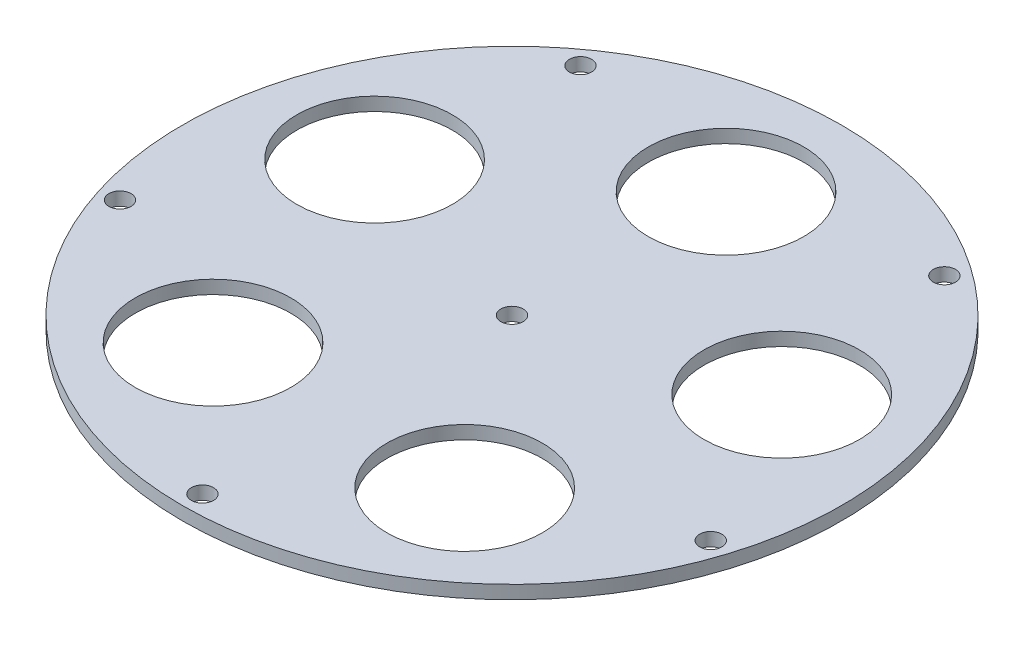
ISO-10303-21;
HEADER;
FILE_DESCRIPTION(('STEP AP214'),'2;1');
FILE_NAME('part.step','',(''),(''),'','','');
FILE_SCHEMA(('AUTOMOTIVE_DESIGN { 1 0 10303 214 1 1 1 1 }'));
ENDSEC;
DATA;
#1=APPLICATION_CONTEXT('core data for automotive mechanical design processes');
#2=APPLICATION_PROTOCOL_DEFINITION('international standard','automotive_design',2000,#1);
#3=PRODUCT_CONTEXT('',#1,'mechanical');
#4=PRODUCT('Part','Part','',(#3));
#5=PRODUCT_RELATED_PRODUCT_CATEGORY('part','',(#4));
#6=PRODUCT_DEFINITION_FORMATION('','',#4);
#7=PRODUCT_DEFINITION_CONTEXT('part definition',#1,'design');
#8=PRODUCT_DEFINITION('design','',#6,#7);
#9=PRODUCT_DEFINITION_SHAPE('','',#8);
#10=(LENGTH_UNIT() NAMED_UNIT(*) SI_UNIT(.MILLI.,.METRE.));
#11=(NAMED_UNIT(*) PLANE_ANGLE_UNIT() SI_UNIT($,.RADIAN.));
#12=(NAMED_UNIT(*) SI_UNIT($,.STERADIAN.) SOLID_ANGLE_UNIT());
#13=UNCERTAINTY_MEASURE_WITH_UNIT(LENGTH_MEASURE(1.E-05),#10,'distance_accuracy_value','');
#14=(GEOMETRIC_REPRESENTATION_CONTEXT(3) GLOBAL_UNCERTAINTY_ASSIGNED_CONTEXT((#13)) GLOBAL_UNIT_ASSIGNED_CONTEXT((#10,
#11,#12)) REPRESENTATION_CONTEXT('',''));
#15=CARTESIAN_POINT('',(0.,0.,0.));
#16=DIRECTION('',(0.,0.,1.));
#17=DIRECTION('',(1.,0.,0.));
#18=AXIS2_PLACEMENT_3D('',#15,#16,#17);
#19=CARTESIAN_POINT('',(0.,-3.,0.));
#20=DIRECTION('',(0.,1.,0.));
#21=DIRECTION('',(0.,0.,1.));
#22=AXIS2_PLACEMENT_3D('',#19,#20,#21);
#23=CYLINDRICAL_SURFACE('',#22,74.18267629);
#24=CARTESIAN_POINT('',(0.,-3.,0.));
#25=DIRECTION('',(0.,1.,0.));
#26=DIRECTION('',(0.,0.,1.));
#27=AXIS2_PLACEMENT_3D('',#24,#25,#26);
#28=CIRCLE('',#27,74.18267629);
#29=CARTESIAN_POINT('',(0.,-3.,74.18267629));
#30=VERTEX_POINT('',#29);
#31=EDGE_CURVE('E10',#30,#30,#28,.T.);
#32=ORIENTED_EDGE('',*,*,#31,.T.);
#33=EDGE_LOOP('',(#32));
#34=FACE_BOUND('',#33,.T.);
#35=CARTESIAN_POINT('',(0.,0.,0.));
#36=DIRECTION('',(0.,1.,0.));
#37=DIRECTION('',(0.,0.,1.));
#38=AXIS2_PLACEMENT_3D('',#35,#36,#37);
#39=CIRCLE('',#38,74.18267629);
#40=CARTESIAN_POINT('',(0.,0.,74.18267629));
#41=VERTEX_POINT('',#40);
#42=EDGE_CURVE('E33',#41,#41,#39,.T.);
#43=ORIENTED_EDGE('',*,*,#42,.F.);
#44=EDGE_LOOP('',(#43));
#45=FACE_BOUND('',#44,.T.);
#46=ADVANCED_FACE('F30',(#34,#45),#23,.T.);
#47=CARTESIAN_POINT('',(0.,-3.,0.));
#48=DIRECTION('',(0.,1.,0.));
#49=DIRECTION('',(0.,0.,1.));
#50=AXIS2_PLACEMENT_3D('',#47,#48,#49);
#51=PLANE('',#50);
#52=CARTESIAN_POINT('',(0.,-3.,0.));
#53=DIRECTION('',(0.,1.,0.));
#54=DIRECTION('',(0.,0.,1.));
#55=AXIS2_PLACEMENT_3D('',#52,#53,#54);
#56=CIRCLE('',#55,2.5);
#57=CARTESIAN_POINT('',(0.,-3.,2.5));
#58=VERTEX_POINT('',#57);
#59=EDGE_CURVE('E91',#58,#58,#56,.T.);
#60=ORIENTED_EDGE('',*,*,#59,.T.);
#61=EDGE_LOOP('',(#60));
#62=FACE_BOUND('',#61,.T.);
#63=CARTESIAN_POINT('',(-66.605033139194,-3.,21.6412871351681));
#64=DIRECTION('',(0.,1.,0.));
#65=DIRECTION('',(0.,0.,1.));
#66=AXIS2_PLACEMENT_3D('',#63,#64,#65);
#67=CIRCLE('',#66,2.5);
#68=CARTESIAN_POINT('',(-66.605033139194,-3.,24.1412871351681));
#69=VERTEX_POINT('',#68);
#70=EDGE_CURVE('E69',#69,#69,#67,.T.);
#71=ORIENTED_EDGE('',*,*,#70,.T.);
#72=EDGE_LOOP('',(#71));
#73=FACE_BOUND('',#72,.T.);
#74=CARTESIAN_POINT('',(0.,-3.,69.68267629));
#75=DIRECTION('',(0.,1.,0.));
#76=DIRECTION('',(0.,0.,1.));
#77=AXIS2_PLACEMENT_3D('',#74,#75,#76);
#78=CIRCLE('',#77,2.5);
#79=CARTESIAN_POINT('',(0.,-3.,72.18267629));
#80=VERTEX_POINT('',#79);
#81=EDGE_CURVE('E74',#80,#80,#78,.T.);
#82=ORIENTED_EDGE('',*,*,#81,.T.);
#83=EDGE_LOOP('',(#82));
#84=FACE_BOUND('',#83,.T.);
#85=CARTESIAN_POINT('',(66.2721633584904,-3.,21.5331311871379));
#86=DIRECTION('',(0.,1.,0.));
#87=DIRECTION('',(0.,0.,1.));
#88=AXIS2_PLACEMENT_3D('',#85,#86,#87);
#89=CIRCLE('',#88,2.5);
#90=CARTESIAN_POINT('',(66.2721633584904,-3.,24.0331311871379));
#91=VERTEX_POINT('',#90);
#92=EDGE_CURVE('E77',#91,#91,#89,.T.);
#93=ORIENTED_EDGE('',*,*,#92,.T.);
#94=EDGE_LOOP('',(#93));
#95=FACE_BOUND('',#94,.T.);
#96=CARTESIAN_POINT('',(40.9584494635325,-3.,-56.3744693321381));
#97=DIRECTION('',(0.,1.,0.));
#98=DIRECTION('',(0.,0.,1.));
#99=AXIS2_PLACEMENT_3D('',#96,#97,#98);
#100=CIRCLE('',#99,2.5);
#101=CARTESIAN_POINT('',(40.9584494635325,-3.,-53.8744693321381));
#102=VERTEX_POINT('',#101);
#103=EDGE_CURVE('E80',#102,#102,#100,.T.);
#104=ORIENTED_EDGE('',*,*,#103,.T.);
#105=EDGE_LOOP('',(#104));
#106=FACE_BOUND('',#105,.T.);
#107=CARTESIAN_POINT('',(-40.9584494635321,-3.,-56.3744693321385));
#108=DIRECTION('',(0.,1.,0.));
#109=DIRECTION('',(0.,0.,1.));
#110=AXIS2_PLACEMENT_3D('',#107,#108,#109);
#111=CIRCLE('',#110,2.5);
#112=CARTESIAN_POINT('',(-40.9584494635321,-3.,-53.8744693321385));
#113=VERTEX_POINT('',#112);
#114=EDGE_CURVE('E83',#113,#113,#111,.T.);
#115=ORIENTED_EDGE('',*,*,#114,.T.);
#116=EDGE_LOOP('',(#115));
#117=FACE_BOUND('',#116,.T.);
#118=CARTESIAN_POINT('',(28.3210665392446,-3.,38.9806039530766));
#119=DIRECTION('',(0.,1.,0.));
#120=DIRECTION('',(0.,0.,1.));
#121=AXIS2_PLACEMENT_3D('',#118,#119,#120);
#122=CIRCLE('',#121,17.5);
#123=CARTESIAN_POINT('',(28.3210665392446,-3.,56.4806039530766));
#124=VERTEX_POINT('',#123);
#125=EDGE_CURVE('E40',#124,#124,#122,.T.);
#126=ORIENTED_EDGE('',*,*,#125,.T.);
#127=EDGE_LOOP('',(#126));
#128=FACE_BOUND('',#127,.T.);
#129=CARTESIAN_POINT('',(45.8244482581444,-3.,-14.8892658080771));
#130=DIRECTION('',(0.,1.,0.));
#131=DIRECTION('',(0.,0.,1.));
#132=AXIS2_PLACEMENT_3D('',#129,#130,#131);
#133=CIRCLE('',#132,17.5);
#134=CARTESIAN_POINT('',(45.8244482581444,-3.,2.61073419192295));
#135=VERTEX_POINT('',#134);
#136=EDGE_CURVE('E44',#135,#135,#133,.T.);
#137=ORIENTED_EDGE('',*,*,#136,.T.);
#138=EDGE_LOOP('',(#137));
#139=FACE_BOUND('',#138,.T.);
#140=CARTESIAN_POINT('',(0.,-3.,-48.18267629));
#141=DIRECTION('',(0.,1.,0.));
#142=DIRECTION('',(0.,0.,1.));
#143=AXIS2_PLACEMENT_3D('',#140,#141,#142);
#144=CIRCLE('',#143,17.5);
#145=CARTESIAN_POINT('',(0.,-3.,-30.68267629));
#146=VERTEX_POINT('',#145);
#147=EDGE_CURVE('E47',#146,#146,#144,.T.);
#148=ORIENTED_EDGE('',*,*,#147,.T.);
#149=EDGE_LOOP('',(#148));
#150=FACE_BOUND('',#149,.T.);
#151=CARTESIAN_POINT('',(-45.8244482581448,-3.,-14.8892658080758));
#152=DIRECTION('',(0.,1.,0.));
#153=DIRECTION('',(0.,0.,1.));
#154=AXIS2_PLACEMENT_3D('',#151,#152,#153);
#155=CIRCLE('',#154,17.5);
#156=CARTESIAN_POINT('',(-45.8244482581448,-3.,2.61073419192416));
#157=VERTEX_POINT('',#156);
#158=EDGE_CURVE('E50',#157,#157,#155,.T.);
#159=ORIENTED_EDGE('',*,*,#158,.T.);
#160=EDGE_LOOP('',(#159));
#161=FACE_BOUND('',#160,.T.);
#162=CARTESIAN_POINT('',(-28.3210665392436,-3.,38.9806039530773));
#163=DIRECTION('',(0.,1.,0.));
#164=DIRECTION('',(0.,0.,1.));
#165=AXIS2_PLACEMENT_3D('',#162,#163,#164);
#166=CIRCLE('',#165,17.5);
#167=CARTESIAN_POINT('',(-28.3210665392436,-3.,56.4806039530773));
#168=VERTEX_POINT('',#167);
#169=EDGE_CURVE('E53',#168,#168,#166,.T.);
#170=ORIENTED_EDGE('',*,*,#169,.T.);
#171=EDGE_LOOP('',(#170));
#172=FACE_BOUND('',#171,.T.);
#173=ORIENTED_EDGE('',*,*,#31,.F.);
#174=EDGE_LOOP('',(#173));
#175=FACE_BOUND('',#174,.T.);
#176=ADVANCED_FACE('F115',(#62,#73,#84,#95,#106,#117,#128,#139,#150,#161,#172,#175),#51,.F.);
#177=CARTESIAN_POINT('',(0.,0.,0.));
#178=DIRECTION('',(0.,1.,0.));
#179=DIRECTION('',(0.,0.,1.));
#180=AXIS2_PLACEMENT_3D('',#177,#178,#179);
#181=PLANE('',#180);
#182=CARTESIAN_POINT('',(0.,0.,0.));
#183=DIRECTION('',(0.,1.,0.));
#184=DIRECTION('',(0.,0.,1.));
#185=AXIS2_PLACEMENT_3D('',#182,#183,#184);
#186=CIRCLE('',#185,2.5);
#187=CARTESIAN_POINT('',(0.,0.,2.5));
#188=VERTEX_POINT('',#187);
#189=EDGE_CURVE('E104',#188,#188,#186,.T.);
#190=ORIENTED_EDGE('',*,*,#189,.F.);
#191=EDGE_LOOP('',(#190));
#192=FACE_BOUND('',#191,.T.);
#193=CARTESIAN_POINT('',(-66.605033139194,0.,21.6412871351681));
#194=DIRECTION('',(0.,1.,0.));
#195=DIRECTION('',(0.,0.,1.));
#196=AXIS2_PLACEMENT_3D('',#193,#194,#195);
#197=CIRCLE('',#196,2.5);
#198=CARTESIAN_POINT('',(-66.605033139194,0.,24.1412871351681));
#199=VERTEX_POINT('',#198);
#200=EDGE_CURVE('E86',#199,#199,#197,.T.);
#201=ORIENTED_EDGE('',*,*,#200,.F.);
#202=EDGE_LOOP('',(#201));
#203=FACE_BOUND('',#202,.T.);
#204=CARTESIAN_POINT('',(0.,0.,69.68267629));
#205=DIRECTION('',(0.,1.,0.));
#206=DIRECTION('',(0.,0.,1.));
#207=AXIS2_PLACEMENT_3D('',#204,#205,#206);
#208=CIRCLE('',#207,2.5);
#209=CARTESIAN_POINT('',(0.,0.,72.18267629));
#210=VERTEX_POINT('',#209);
#211=EDGE_CURVE('E97',#210,#210,#208,.T.);
#212=ORIENTED_EDGE('',*,*,#211,.F.);
#213=EDGE_LOOP('',(#212));
#214=FACE_BOUND('',#213,.T.);
#215=CARTESIAN_POINT('',(66.2721633584904,0.,21.5331311871379));
#216=DIRECTION('',(0.,1.,0.));
#217=DIRECTION('',(0.,0.,1.));
#218=AXIS2_PLACEMENT_3D('',#215,#216,#217);
#219=CIRCLE('',#218,2.5);
#220=CARTESIAN_POINT('',(66.2721633584904,0.,24.0331311871379));
#221=VERTEX_POINT('',#220);
#222=EDGE_CURVE('E94',#221,#221,#219,.T.);
#223=ORIENTED_EDGE('',*,*,#222,.F.);
#224=EDGE_LOOP('',(#223));
#225=FACE_BOUND('',#224,.T.);
#226=CARTESIAN_POINT('',(40.9584494635325,0.,-56.3744693321381));
#227=DIRECTION('',(0.,1.,0.));
#228=DIRECTION('',(0.,0.,1.));
#229=AXIS2_PLACEMENT_3D('',#226,#227,#228);
#230=CIRCLE('',#229,2.5);
#231=CARTESIAN_POINT('',(40.9584494635325,0.,-53.8744693321381));
#232=VERTEX_POINT('',#231);
#233=EDGE_CURVE('E90',#232,#232,#230,.T.);
#234=ORIENTED_EDGE('',*,*,#233,.F.);
#235=EDGE_LOOP('',(#234));
#236=FACE_BOUND('',#235,.T.);
#237=CARTESIAN_POINT('',(-40.9584494635321,0.,-56.3744693321385));
#238=DIRECTION('',(0.,1.,0.));
#239=DIRECTION('',(0.,0.,1.));
#240=AXIS2_PLACEMENT_3D('',#237,#238,#239);
#241=CIRCLE('',#240,2.5);
#242=CARTESIAN_POINT('',(-40.9584494635321,0.,-53.8744693321385));
#243=VERTEX_POINT('',#242);
#244=EDGE_CURVE('E87',#243,#243,#241,.T.);
#245=ORIENTED_EDGE('',*,*,#244,.F.);
#246=EDGE_LOOP('',(#245));
#247=FACE_BOUND('',#246,.T.);
#248=CARTESIAN_POINT('',(28.3210665392446,0.,38.9806039530766));
#249=DIRECTION('',(0.,1.,0.));
#250=DIRECTION('',(0.,0.,1.));
#251=AXIS2_PLACEMENT_3D('',#248,#249,#250);
#252=CIRCLE('',#251,17.5);
#253=CARTESIAN_POINT('',(28.3210665392446,0.,56.4806039530766));
#254=VERTEX_POINT('',#253);
#255=EDGE_CURVE('E59',#254,#254,#252,.T.);
#256=ORIENTED_EDGE('',*,*,#255,.F.);
#257=EDGE_LOOP('',(#256));
#258=FACE_BOUND('',#257,.T.);
#259=CARTESIAN_POINT('',(45.8244482581444,0.,-14.8892658080771));
#260=DIRECTION('',(0.,1.,0.));
#261=DIRECTION('',(0.,0.,1.));
#262=AXIS2_PLACEMENT_3D('',#259,#260,#261);
#263=CIRCLE('',#262,17.5);
#264=CARTESIAN_POINT('',(45.8244482581444,0.,2.61073419192295));
#265=VERTEX_POINT('',#264);
#266=EDGE_CURVE('E60',#265,#265,#263,.T.);
#267=ORIENTED_EDGE('',*,*,#266,.F.);
#268=EDGE_LOOP('',(#267));
#269=FACE_BOUND('',#268,.T.);
#270=CARTESIAN_POINT('',(0.,0.,-48.18267629));
#271=DIRECTION('',(0.,1.,0.));
#272=DIRECTION('',(0.,0.,1.));
#273=AXIS2_PLACEMENT_3D('',#270,#271,#272);
#274=CIRCLE('',#273,17.5);
#275=CARTESIAN_POINT('',(0.,0.,-30.68267629));
#276=VERTEX_POINT('',#275);
#277=EDGE_CURVE('E63',#276,#276,#274,.T.);
#278=ORIENTED_EDGE('',*,*,#277,.F.);
#279=EDGE_LOOP('',(#278));
#280=FACE_BOUND('',#279,.T.);
#281=CARTESIAN_POINT('',(-45.8244482581448,0.,-14.8892658080758));
#282=DIRECTION('',(0.,1.,0.));
#283=DIRECTION('',(0.,0.,1.));
#284=AXIS2_PLACEMENT_3D('',#281,#282,#283);
#285=CIRCLE('',#284,17.5);
#286=CARTESIAN_POINT('',(-45.8244482581448,0.,2.61073419192416));
#287=VERTEX_POINT('',#286);
#288=EDGE_CURVE('E66',#287,#287,#285,.T.);
#289=ORIENTED_EDGE('',*,*,#288,.F.);
#290=EDGE_LOOP('',(#289));
#291=FACE_BOUND('',#290,.T.);
#292=CARTESIAN_POINT('',(-28.3210665392436,0.,38.9806039530773));
#293=DIRECTION('',(0.,1.,0.));
#294=DIRECTION('',(0.,0.,1.));
#295=AXIS2_PLACEMENT_3D('',#292,#293,#294);
#296=CIRCLE('',#295,17.5);
#297=CARTESIAN_POINT('',(-28.3210665392436,0.,56.4806039530773));
#298=VERTEX_POINT('',#297);
#299=EDGE_CURVE('E56',#298,#298,#296,.T.);
#300=ORIENTED_EDGE('',*,*,#299,.F.);
#301=EDGE_LOOP('',(#300));
#302=FACE_BOUND('',#301,.T.);
#303=ORIENTED_EDGE('',*,*,#42,.T.);
#304=EDGE_LOOP('',(#303));
#305=FACE_BOUND('',#304,.T.);
#306=ADVANCED_FACE('F111',(#192,#203,#214,#225,#236,#247,#258,#269,#280,#291,#302,#305),#181,.T.);
#307=CARTESIAN_POINT('',(-28.3210665392436,-4.,38.9806039530773));
#308=DIRECTION('',(0.,1.,0.));
#309=DIRECTION('',(0.,0.,1.));
#310=AXIS2_PLACEMENT_3D('',#307,#308,#309);
#311=CYLINDRICAL_SURFACE('',#310,17.5);
#312=ORIENTED_EDGE('',*,*,#299,.T.);
#313=EDGE_LOOP('',(#312));
#314=FACE_BOUND('',#313,.T.);
#315=ORIENTED_EDGE('',*,*,#169,.F.);
#316=EDGE_LOOP('',(#315));
#317=FACE_BOUND('',#316,.T.);
#318=ADVANCED_FACE('F114',(#314,#317),#311,.F.);
#319=CARTESIAN_POINT('',(-45.8244482581448,-4.,-14.8892658080758));
#320=DIRECTION('',(0.,1.,0.));
#321=DIRECTION('',(0.,0.,1.));
#322=AXIS2_PLACEMENT_3D('',#319,#320,#321);
#323=CYLINDRICAL_SURFACE('',#322,17.5);
#324=ORIENTED_EDGE('',*,*,#288,.T.);
#325=EDGE_LOOP('',(#324));
#326=FACE_BOUND('',#325,.T.);
#327=ORIENTED_EDGE('',*,*,#158,.F.);
#328=EDGE_LOOP('',(#327));
#329=FACE_BOUND('',#328,.T.);
#330=ADVANCED_FACE('F150',(#326,#329),#323,.F.);
#331=CARTESIAN_POINT('',(0.,-4.,-48.18267629));
#332=DIRECTION('',(0.,1.,0.));
#333=DIRECTION('',(0.,0.,1.));
#334=AXIS2_PLACEMENT_3D('',#331,#332,#333);
#335=CYLINDRICAL_SURFACE('',#334,17.5);
#336=ORIENTED_EDGE('',*,*,#277,.T.);
#337=EDGE_LOOP('',(#336));
#338=FACE_BOUND('',#337,.T.);
#339=ORIENTED_EDGE('',*,*,#147,.F.);
#340=EDGE_LOOP('',(#339));
#341=FACE_BOUND('',#340,.T.);
#342=ADVANCED_FACE('F156',(#338,#341),#335,.F.);
#343=CARTESIAN_POINT('',(45.8244482581444,-4.,-14.8892658080771));
#344=DIRECTION('',(0.,1.,0.));
#345=DIRECTION('',(0.,0.,1.));
#346=AXIS2_PLACEMENT_3D('',#343,#344,#345);
#347=CYLINDRICAL_SURFACE('',#346,17.5);
#348=ORIENTED_EDGE('',*,*,#266,.T.);
#349=EDGE_LOOP('',(#348));
#350=FACE_BOUND('',#349,.T.);
#351=ORIENTED_EDGE('',*,*,#136,.F.);
#352=EDGE_LOOP('',(#351));
#353=FACE_BOUND('',#352,.T.);
#354=ADVANCED_FACE('F152',(#350,#353),#347,.F.);
#355=CARTESIAN_POINT('',(28.3210665392446,-4.,38.9806039530766));
#356=DIRECTION('',(0.,1.,0.));
#357=DIRECTION('',(0.,0.,1.));
#358=AXIS2_PLACEMENT_3D('',#355,#356,#357);
#359=CYLINDRICAL_SURFACE('',#358,17.5);
#360=ORIENTED_EDGE('',*,*,#255,.T.);
#361=EDGE_LOOP('',(#360));
#362=FACE_BOUND('',#361,.T.);
#363=ORIENTED_EDGE('',*,*,#125,.F.);
#364=EDGE_LOOP('',(#363));
#365=FACE_BOUND('',#364,.T.);
#366=ADVANCED_FACE('F155',(#362,#365),#359,.F.);
#367=CARTESIAN_POINT('',(-40.9584494635321,-4.,-56.3744693321385));
#368=DIRECTION('',(0.,1.,0.));
#369=DIRECTION('',(0.,0.,1.));
#370=AXIS2_PLACEMENT_3D('',#367,#368,#369);
#371=CYLINDRICAL_SURFACE('',#370,2.5);
#372=ORIENTED_EDGE('',*,*,#244,.T.);
#373=EDGE_LOOP('',(#372));
#374=FACE_BOUND('',#373,.T.);
#375=ORIENTED_EDGE('',*,*,#114,.F.);
#376=EDGE_LOOP('',(#375));
#377=FACE_BOUND('',#376,.T.);
#378=ADVANCED_FACE('F160',(#374,#377),#371,.F.);
#379=CARTESIAN_POINT('',(40.9584494635325,-4.,-56.3744693321381));
#380=DIRECTION('',(0.,1.,0.));
#381=DIRECTION('',(0.,0.,1.));
#382=AXIS2_PLACEMENT_3D('',#379,#380,#381);
#383=CYLINDRICAL_SURFACE('',#382,2.5);
#384=ORIENTED_EDGE('',*,*,#233,.T.);
#385=EDGE_LOOP('',(#384));
#386=FACE_BOUND('',#385,.T.);
#387=ORIENTED_EDGE('',*,*,#103,.F.);
#388=EDGE_LOOP('',(#387));
#389=FACE_BOUND('',#388,.T.);
#390=ADVANCED_FACE('F170',(#386,#389),#383,.F.);
#391=CARTESIAN_POINT('',(66.2721633584904,-4.,21.5331311871379));
#392=DIRECTION('',(0.,1.,0.));
#393=DIRECTION('',(0.,0.,1.));
#394=AXIS2_PLACEMENT_3D('',#391,#392,#393);
#395=CYLINDRICAL_SURFACE('',#394,2.5);
#396=ORIENTED_EDGE('',*,*,#222,.T.);
#397=EDGE_LOOP('',(#396));
#398=FACE_BOUND('',#397,.T.);
#399=ORIENTED_EDGE('',*,*,#92,.F.);
#400=EDGE_LOOP('',(#399));
#401=FACE_BOUND('',#400,.T.);
#402=ADVANCED_FACE('F174',(#398,#401),#395,.F.);
#403=CARTESIAN_POINT('',(0.,-4.,69.68267629));
#404=DIRECTION('',(0.,1.,0.));
#405=DIRECTION('',(0.,0.,1.));
#406=AXIS2_PLACEMENT_3D('',#403,#404,#405);
#407=CYLINDRICAL_SURFACE('',#406,2.5);
#408=ORIENTED_EDGE('',*,*,#211,.T.);
#409=EDGE_LOOP('',(#408));
#410=FACE_BOUND('',#409,.T.);
#411=ORIENTED_EDGE('',*,*,#81,.F.);
#412=EDGE_LOOP('',(#411));
#413=FACE_BOUND('',#412,.T.);
#414=ADVANCED_FACE('F178',(#410,#413),#407,.F.);
#415=CARTESIAN_POINT('',(-66.605033139194,-4.,21.6412871351681));
#416=DIRECTION('',(0.,1.,0.));
#417=DIRECTION('',(0.,0.,1.));
#418=AXIS2_PLACEMENT_3D('',#415,#416,#417);
#419=CYLINDRICAL_SURFACE('',#418,2.5);
#420=ORIENTED_EDGE('',*,*,#200,.T.);
#421=EDGE_LOOP('',(#420));
#422=FACE_BOUND('',#421,.T.);
#423=ORIENTED_EDGE('',*,*,#70,.F.);
#424=EDGE_LOOP('',(#423));
#425=FACE_BOUND('',#424,.T.);
#426=ADVANCED_FACE('F182',(#422,#425),#419,.F.);
#427=CARTESIAN_POINT('',(0.,-10.,0.));
#428=DIRECTION('',(0.,1.,0.));
#429=DIRECTION('',(0.,0.,1.));
#430=AXIS2_PLACEMENT_3D('',#427,#428,#429);
#431=CYLINDRICAL_SURFACE('',#430,2.5);
#432=ORIENTED_EDGE('',*,*,#189,.T.);
#433=EDGE_LOOP('',(#432));
#434=FACE_BOUND('',#433,.T.);
#435=ORIENTED_EDGE('',*,*,#59,.F.);
#436=EDGE_LOOP('',(#435));
#437=FACE_BOUND('',#436,.T.);
#438=ADVANCED_FACE('F108',(#434,#437),#431,.F.);
#439=CLOSED_SHELL('',(#46,#176,#306,#318,#330,#342,#354,#366,#378,#390,#402,#414,#426,#438));
#440=MANIFOLD_SOLID_BREP('B2',#439);
#441=ADVANCED_BREP_SHAPE_REPRESENTATION('',(#18,#440),#14);
#442=SHAPE_DEFINITION_REPRESENTATION(#9,#441);
ENDSEC;
END-ISO-10303-21;
